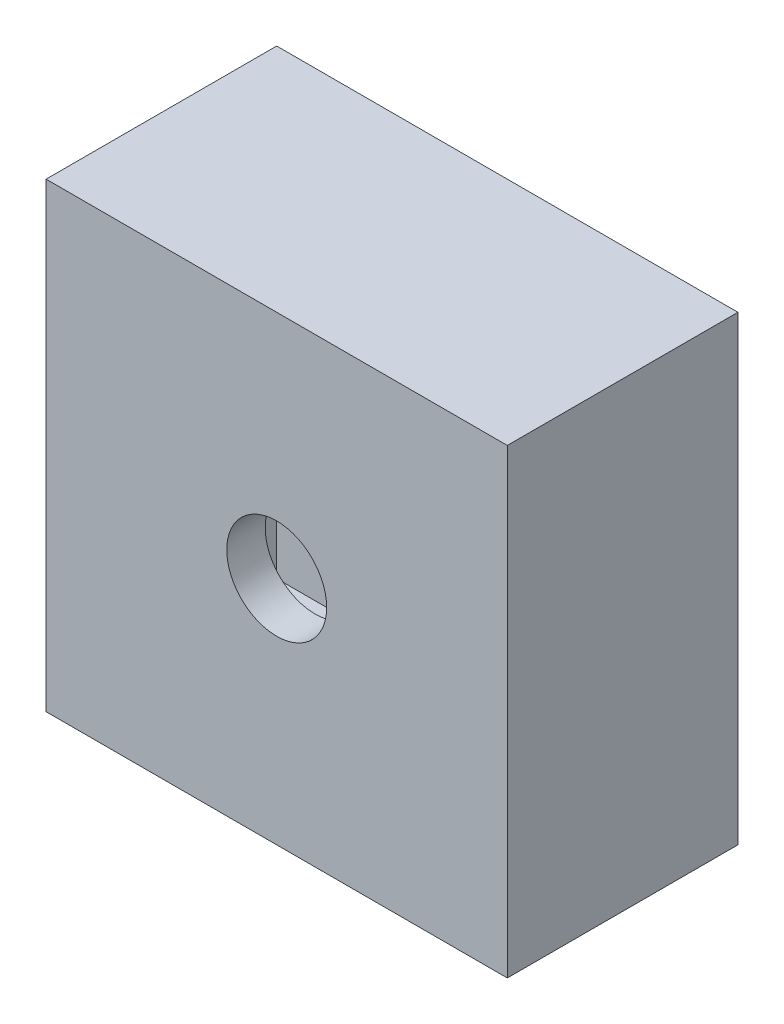
ISO-10303-21;
HEADER;
FILE_DESCRIPTION(('STEP AP214'),'2;1');
FILE_NAME('part.step','',(''),(''),'','','');
FILE_SCHEMA(('AUTOMOTIVE_DESIGN { 1 0 10303 214 1 1 1 1 }'));
ENDSEC;
DATA;
#1=APPLICATION_CONTEXT('core data for automotive mechanical design processes');
#2=APPLICATION_PROTOCOL_DEFINITION('international standard','automotive_design',2000,#1);
#3=PRODUCT_CONTEXT('',#1,'mechanical');
#4=PRODUCT('Part','Part','',(#3));
#5=PRODUCT_RELATED_PRODUCT_CATEGORY('part','',(#4));
#6=PRODUCT_DEFINITION_FORMATION('','',#4);
#7=PRODUCT_DEFINITION_CONTEXT('part definition',#1,'design');
#8=PRODUCT_DEFINITION('design','',#6,#7);
#9=PRODUCT_DEFINITION_SHAPE('','',#8);
#10=(LENGTH_UNIT() NAMED_UNIT(*) SI_UNIT(.MILLI.,.METRE.));
#11=(NAMED_UNIT(*) PLANE_ANGLE_UNIT() SI_UNIT($,.RADIAN.));
#12=(NAMED_UNIT(*) SI_UNIT($,.STERADIAN.) SOLID_ANGLE_UNIT());
#13=UNCERTAINTY_MEASURE_WITH_UNIT(LENGTH_MEASURE(1.E-05),#10,'distance_accuracy_value','');
#14=(GEOMETRIC_REPRESENTATION_CONTEXT(3) GLOBAL_UNCERTAINTY_ASSIGNED_CONTEXT((#13)) GLOBAL_UNIT_ASSIGNED_CONTEXT((#10,
#11,#12)) REPRESENTATION_CONTEXT('',''));
#15=CARTESIAN_POINT('',(0.,0.,0.));
#16=DIRECTION('',(0.,0.,1.));
#17=DIRECTION('',(1.,0.,0.));
#18=AXIS2_PLACEMENT_3D('',#15,#16,#17);
#19=CARTESIAN_POINT('',(0.,0.,100.));
#20=DIRECTION('',(0.,0.,-1.));
#21=DIRECTION('',(-1.,0.,0.));
#22=AXIS2_PLACEMENT_3D('',#19,#20,#21);
#23=PLANE('',#22);
#24=DIRECTION('',(0.,-1.,0.));
#25=VECTOR('',#24,1.);
#26=CARTESIAN_POINT('',(65.,2.26946287024804E-13,100.));
#27=LINE('',#26,#25);
#28=CARTESIAN_POINT('',(64.9999999999987,375.,100.));
#29=VERTEX_POINT('',#28);
#30=CARTESIAN_POINT('',(64.9999999999992,245.,100.));
#31=VERTEX_POINT('',#30);
#32=EDGE_CURVE('E331',#29,#31,#27,.T.);
#33=ORIENTED_EDGE('',*,*,#32,.T.);
#34=DIRECTION('',(-1.,0.,0.));
#35=VECTOR('',#34,1.);
#36=CARTESIAN_POINT('',(-8.55412928016568E-13,245.,100.));
#37=LINE('',#36,#35);
#38=CARTESIAN_POINT('',(-65.0000000000009,245.,100.));
#39=VERTEX_POINT('',#38);
#40=EDGE_CURVE('E335',#31,#39,#37,.T.);
#41=ORIENTED_EDGE('',*,*,#40,.T.);
#42=DIRECTION('',(0.,1.,0.));
#43=VECTOR('',#42,1.);
#44=CARTESIAN_POINT('',(-65.,-2.26946287024804E-13,100.));
#45=LINE('',#44,#43);
#46=CARTESIAN_POINT('',(-65.0000000000013,375.,100.));
#47=VERTEX_POINT('',#46);
#48=EDGE_CURVE('E326',#39,#47,#45,.T.);
#49=ORIENTED_EDGE('',*,*,#48,.T.);
#50=DIRECTION('',(1.,0.,0.));
#51=VECTOR('',#50,1.);
#52=CARTESIAN_POINT('',(-1.30930550206618E-12,375.,100.));
#53=LINE('',#52,#51);
#54=EDGE_CURVE('E207',#47,#29,#53,.T.);
#55=ORIENTED_EDGE('',*,*,#54,.T.);
#56=EDGE_LOOP('',(#33,#41,#49,#55));
#57=FACE_BOUND('',#56,.T.);
#58=DIRECTION('',(1.,0.,0.));
#59=VECTOR('',#58,1.);
#60=CARTESIAN_POINT('',(0.,65.,100.));
#61=LINE('',#60,#59);
#62=CARTESIAN_POINT('',(-375.,65.,100.));
#63=VERTEX_POINT('',#62);
#64=CARTESIAN_POINT('',(-245.,65.,100.));
#65=VERTEX_POINT('',#64);
#66=EDGE_CURVE('E318',#63,#65,#61,.T.);
#67=ORIENTED_EDGE('',*,*,#66,.T.);
#68=DIRECTION('',(0.,-1.,0.));
#69=VECTOR('',#68,1.);
#70=CARTESIAN_POINT('',(-245.,0.,100.));
#71=LINE('',#70,#69);
#72=CARTESIAN_POINT('',(-245.,-65.,100.));
#73=VERTEX_POINT('',#72);
#74=EDGE_CURVE('E322',#65,#73,#71,.T.);
#75=ORIENTED_EDGE('',*,*,#74,.T.);
#76=DIRECTION('',(-1.,0.,0.));
#77=VECTOR('',#76,1.);
#78=CARTESIAN_POINT('',(0.,-65.,100.));
#79=LINE('',#78,#77);
#80=CARTESIAN_POINT('',(-375.,-65.,100.));
#81=VERTEX_POINT('',#80);
#82=EDGE_CURVE('E310',#73,#81,#79,.T.);
#83=ORIENTED_EDGE('',*,*,#82,.T.);
#84=DIRECTION('',(0.,1.,0.));
#85=VECTOR('',#84,1.);
#86=CARTESIAN_POINT('',(-375.,0.,100.));
#87=LINE('',#86,#85);
#88=EDGE_CURVE('E314',#81,#63,#87,.T.);
#89=ORIENTED_EDGE('',*,*,#88,.T.);
#90=EDGE_LOOP('',(#67,#75,#83,#89));
#91=FACE_BOUND('',#90,.T.);
#92=DIRECTION('',(0.,1.,0.));
#93=VECTOR('',#92,1.);
#94=CARTESIAN_POINT('',(-65.,-6.80838861074411E-13,100.));
#95=LINE('',#94,#93);
#96=CARTESIAN_POINT('',(-64.9999999999961,-375.000000000001,100.));
#97=VERTEX_POINT('',#96);
#98=CARTESIAN_POINT('',(-64.9999999999974,-245.000000000001,100.));
#99=VERTEX_POINT('',#98);
#100=EDGE_CURVE('E302',#97,#99,#95,.T.);
#101=ORIENTED_EDGE('',*,*,#100,.T.);
#102=DIRECTION('',(1.,0.,0.));
#103=VECTOR('',#102,1.);
#104=CARTESIAN_POINT('',(2.5662387840497E-12,-245.,100.));
#105=LINE('',#104,#103);
#106=CARTESIAN_POINT('',(65.0000000000026,-244.999999999999,100.));
#107=VERTEX_POINT('',#106);
#108=EDGE_CURVE('E306',#99,#107,#105,.T.);
#109=ORIENTED_EDGE('',*,*,#108,.T.);
#110=DIRECTION('',(0.,-1.,0.));
#111=VECTOR('',#110,1.);
#112=CARTESIAN_POINT('',(65.,6.80838861074411E-13,100.));
#113=LINE('',#112,#111);
#114=CARTESIAN_POINT('',(65.0000000000039,-374.999999999999,100.));
#115=VERTEX_POINT('',#114);
#116=EDGE_CURVE('E236',#107,#115,#113,.T.);
#117=ORIENTED_EDGE('',*,*,#116,.T.);
#118=DIRECTION('',(-1.,0.,0.));
#119=VECTOR('',#118,1.);
#120=CARTESIAN_POINT('',(3.92791650619853E-12,-375.,100.));
#121=LINE('',#120,#119);
#122=EDGE_CURVE('E298',#115,#97,#121,.T.);
#123=ORIENTED_EDGE('',*,*,#122,.T.);
#124=EDGE_LOOP('',(#101,#109,#117,#123));
#125=FACE_BOUND('',#124,.T.);
#126=DIRECTION('',(-1.,0.,0.));
#127=VECTOR('',#126,1.);
#128=CARTESIAN_POINT('',(0.,-65.,100.));
#129=LINE('',#128,#127);
#130=CARTESIAN_POINT('',(375.,-65.,100.));
#131=VERTEX_POINT('',#130);
#132=CARTESIAN_POINT('',(245.,-65.,100.));
#133=VERTEX_POINT('',#132);
#134=EDGE_CURVE('E375',#131,#133,#129,.T.);
#135=ORIENTED_EDGE('',*,*,#134,.T.);
#136=DIRECTION('',(0.,1.,0.));
#137=VECTOR('',#136,1.);
#138=CARTESIAN_POINT('',(245.,0.,100.));
#139=LINE('',#138,#137);
#140=CARTESIAN_POINT('',(245.,65.,100.));
#141=VERTEX_POINT('',#140);
#142=EDGE_CURVE('E379',#133,#141,#139,.T.);
#143=ORIENTED_EDGE('',*,*,#142,.T.);
#144=DIRECTION('',(1.,0.,0.));
#145=VECTOR('',#144,1.);
#146=CARTESIAN_POINT('',(0.,65.,100.));
#147=LINE('',#146,#145);
#148=CARTESIAN_POINT('',(375.,65.,100.));
#149=VERTEX_POINT('',#148);
#150=EDGE_CURVE('E358',#141,#149,#147,.T.);
#151=ORIENTED_EDGE('',*,*,#150,.T.);
#152=DIRECTION('',(0.,-1.,0.));
#153=VECTOR('',#152,1.);
#154=CARTESIAN_POINT('',(375.,0.,100.));
#155=LINE('',#154,#153);
#156=EDGE_CURVE('E371',#149,#131,#155,.T.);
#157=ORIENTED_EDGE('',*,*,#156,.T.);
#158=EDGE_LOOP('',(#135,#143,#151,#157));
#159=FACE_BOUND('',#158,.T.);
#160=CARTESIAN_POINT('',(0.,0.,100.));
#161=DIRECTION('',(0.,0.,-1.));
#162=DIRECTION('',(-1.,0.,0.));
#163=AXIS2_PLACEMENT_3D('',#160,#161,#162);
#164=CIRCLE('',#163,130.);
#165=CARTESIAN_POINT('',(-130.,0.,100.));
#166=VERTEX_POINT('',#165);
#167=EDGE_CURVE('E391',#166,#166,#164,.F.);
#168=ORIENTED_EDGE('',*,*,#167,.F.);
#169=EDGE_LOOP('',(#168));
#170=FACE_BOUND('',#169,.T.);
#171=DIRECTION('',(0.,1.,0.));
#172=VECTOR('',#171,1.);
#173=CARTESIAN_POINT('',(500.,0.,100.));
#174=LINE('',#173,#172);
#175=CARTESIAN_POINT('',(500.,-500.,100.));
#176=VERTEX_POINT('',#175);
#177=CARTESIAN_POINT('',(500.,500.,100.));
#178=VERTEX_POINT('',#177);
#179=EDGE_CURVE('E407',#176,#178,#174,.T.);
#180=ORIENTED_EDGE('',*,*,#179,.T.);
#181=DIRECTION('',(-1.,0.,0.));
#182=VECTOR('',#181,1.);
#183=CARTESIAN_POINT('',(0.,500.,100.));
#184=LINE('',#183,#182);
#185=CARTESIAN_POINT('',(-500.,500.,100.));
#186=VERTEX_POINT('',#185);
#187=EDGE_CURVE('E411',#178,#186,#184,.T.);
#188=ORIENTED_EDGE('',*,*,#187,.T.);
#189=DIRECTION('',(0.,-1.,0.));
#190=VECTOR('',#189,1.);
#191=CARTESIAN_POINT('',(-500.,0.,100.));
#192=LINE('',#191,#190);
#193=CARTESIAN_POINT('',(-500.,-500.,100.));
#194=VERTEX_POINT('',#193);
#195=EDGE_CURVE('E425',#186,#194,#192,.T.);
#196=ORIENTED_EDGE('',*,*,#195,.T.);
#197=DIRECTION('',(1.,0.,0.));
#198=VECTOR('',#197,1.);
#199=CARTESIAN_POINT('',(0.,-500.,100.));
#200=LINE('',#199,#198);
#201=EDGE_CURVE('E421',#194,#176,#200,.T.);
#202=ORIENTED_EDGE('',*,*,#201,.T.);
#203=EDGE_LOOP('',(#180,#188,#196,#202));
#204=FACE_BOUND('',#203,.T.);
#205=ADVANCED_FACE('F39',(#57,#91,#125,#159,#170,#204),#23,.F.);
#206=CARTESIAN_POINT('',(-600.,-500.,600.));
#207=DIRECTION('',(0.,1.,0.));
#208=DIRECTION('',(0.,0.,1.));
#209=AXIS2_PLACEMENT_3D('',#206,#207,#208);
#210=PLANE('',#209);
#211=DIRECTION('',(0.,0.,-1.));
#212=VECTOR('',#211,1.);
#213=CARTESIAN_POINT('',(-500.,-500.,600.));
#214=LINE('',#213,#212);
#215=CARTESIAN_POINT('',(-500.,-500.,500.));
#216=VERTEX_POINT('',#215);
#217=EDGE_CURVE('E420',#216,#194,#214,.T.);
#218=ORIENTED_EDGE('',*,*,#217,.F.);
#219=DIRECTION('',(1.,0.,0.));
#220=VECTOR('',#219,1.);
#221=CARTESIAN_POINT('',(-600.,-500.,500.));
#222=LINE('',#221,#220);
#223=CARTESIAN_POINT('',(500.,-500.,500.));
#224=VERTEX_POINT('',#223);
#225=EDGE_CURVE('E11',#216,#224,#222,.T.);
#226=ORIENTED_EDGE('',*,*,#225,.T.);
#227=DIRECTION('',(0.,0.,-1.));
#228=VECTOR('',#227,1.);
#229=CARTESIAN_POINT('',(500.,-500.,600.));
#230=LINE('',#229,#228);
#231=EDGE_CURVE('E417',#224,#176,#230,.T.);
#232=ORIENTED_EDGE('',*,*,#231,.T.);
#233=ORIENTED_EDGE('',*,*,#201,.F.);
#234=EDGE_LOOP('',(#218,#226,#232,#233));
#235=FACE_BOUND('',#234,.T.);
#236=ADVANCED_FACE('F510',(#235),#210,.T.);
#237=CARTESIAN_POINT('',(-500.,-600.,600.));
#238=DIRECTION('',(1.,0.,0.));
#239=DIRECTION('',(0.,0.,-1.));
#240=AXIS2_PLACEMENT_3D('',#237,#238,#239);
#241=PLANE('',#240);
#242=DIRECTION('',(0.,0.,-1.));
#243=VECTOR('',#242,1.);
#244=CARTESIAN_POINT('',(-500.,500.,600.));
#245=LINE('',#244,#243);
#246=CARTESIAN_POINT('',(-500.,500.,500.));
#247=VERTEX_POINT('',#246);
#248=EDGE_CURVE('E416',#247,#186,#245,.T.);
#249=ORIENTED_EDGE('',*,*,#248,.F.);
#250=DIRECTION('',(0.,-1.,0.));
#251=VECTOR('',#250,1.);
#252=CARTESIAN_POINT('',(-500.,-600.,500.));
#253=LINE('',#252,#251);
#254=EDGE_CURVE('E395',#247,#216,#253,.T.);
#255=ORIENTED_EDGE('',*,*,#254,.T.);
#256=ORIENTED_EDGE('',*,*,#217,.T.);
#257=ORIENTED_EDGE('',*,*,#195,.F.);
#258=EDGE_LOOP('',(#249,#255,#256,#257));
#259=FACE_BOUND('',#258,.T.);
#260=ADVANCED_FACE('F515',(#259),#241,.T.);
#261=CARTESIAN_POINT('',(-600.,500.,600.));
#262=DIRECTION('',(0.,-1.,0.));
#263=DIRECTION('',(0.,0.,-1.));
#264=AXIS2_PLACEMENT_3D('',#261,#262,#263);
#265=PLANE('',#264);
#266=DIRECTION('',(0.,0.,-1.));
#267=VECTOR('',#266,1.);
#268=CARTESIAN_POINT('',(500.,500.,600.));
#269=LINE('',#268,#267);
#270=CARTESIAN_POINT('',(500.,500.,500.));
#271=VERTEX_POINT('',#270);
#272=EDGE_CURVE('E412',#271,#178,#269,.T.);
#273=ORIENTED_EDGE('',*,*,#272,.F.);
#274=DIRECTION('',(-1.,0.,0.));
#275=VECTOR('',#274,1.);
#276=CARTESIAN_POINT('',(-600.,500.,500.));
#277=LINE('',#276,#275);
#278=EDGE_CURVE('E399',#271,#247,#277,.T.);
#279=ORIENTED_EDGE('',*,*,#278,.T.);
#280=ORIENTED_EDGE('',*,*,#248,.T.);
#281=ORIENTED_EDGE('',*,*,#187,.F.);
#282=EDGE_LOOP('',(#273,#279,#280,#281));
#283=FACE_BOUND('',#282,.T.);
#284=ADVANCED_FACE('F522',(#283),#265,.T.);
#285=CARTESIAN_POINT('',(500.,-600.,600.));
#286=DIRECTION('',(-1.,0.,0.));
#287=DIRECTION('',(0.,0.,1.));
#288=AXIS2_PLACEMENT_3D('',#285,#286,#287);
#289=PLANE('',#288);
#290=ORIENTED_EDGE('',*,*,#231,.F.);
#291=DIRECTION('',(0.,1.,0.));
#292=VECTOR('',#291,1.);
#293=CARTESIAN_POINT('',(500.,-600.,500.));
#294=LINE('',#293,#292);
#295=EDGE_CURVE('E403',#224,#271,#294,.T.);
#296=ORIENTED_EDGE('',*,*,#295,.T.);
#297=ORIENTED_EDGE('',*,*,#272,.T.);
#298=ORIENTED_EDGE('',*,*,#179,.F.);
#299=EDGE_LOOP('',(#290,#296,#297,#298));
#300=FACE_BOUND('',#299,.T.);
#301=ADVANCED_FACE('F526',(#300),#289,.T.);
#302=CARTESIAN_POINT('',(0.,0.,500.));
#303=DIRECTION('',(0.,0.,1.));
#304=DIRECTION('',(1.,0.,0.));
#305=AXIS2_PLACEMENT_3D('',#302,#303,#304);
#306=PLANE('',#305);
#307=CARTESIAN_POINT('',(0.,0.,500.));
#308=DIRECTION('',(0.,0.,1.));
#309=DIRECTION('',(1.,0.,0.));
#310=AXIS2_PLACEMENT_3D('',#307,#308,#309);
#311=CIRCLE('',#310,130.);
#312=CARTESIAN_POINT('',(130.,0.,500.));
#313=VERTEX_POINT('',#312);
#314=EDGE_CURVE('E43',#313,#313,#311,.F.);
#315=ORIENTED_EDGE('',*,*,#314,.F.);
#316=EDGE_LOOP('',(#315));
#317=FACE_BOUND('',#316,.T.);
#318=ORIENTED_EDGE('',*,*,#295,.F.);
#319=ORIENTED_EDGE('',*,*,#225,.F.);
#320=ORIENTED_EDGE('',*,*,#254,.F.);
#321=ORIENTED_EDGE('',*,*,#278,.F.);
#322=EDGE_LOOP('',(#318,#319,#320,#321));
#323=FACE_BOUND('',#322,.T.);
#324=ADVANCED_FACE('F530',(#317,#323),#306,.F.);
#325=CARTESIAN_POINT('',(0.,0.,600.));
#326=DIRECTION('',(0.,0.,-1.));
#327=DIRECTION('',(-1.,0.,0.));
#328=AXIS2_PLACEMENT_3D('',#325,#326,#327);
#329=CYLINDRICAL_SURFACE('',#328,130.);
#330=CARTESIAN_POINT('',(0.,0.,600.));
#331=DIRECTION('',(0.,0.,1.));
#332=DIRECTION('',(1.,0.,0.));
#333=AXIS2_PLACEMENT_3D('',#330,#331,#332);
#334=CIRCLE('',#333,130.);
#335=CARTESIAN_POINT('',(130.,0.,600.));
#336=VERTEX_POINT('',#335);
#337=EDGE_CURVE('E384',#336,#336,#334,.T.);
#338=ORIENTED_EDGE('',*,*,#337,.T.);
#339=EDGE_LOOP('',(#338));
#340=FACE_BOUND('',#339,.T.);
#341=ORIENTED_EDGE('',*,*,#314,.T.);
#342=EDGE_LOOP('',(#341));
#343=FACE_BOUND('',#342,.T.);
#344=ADVANCED_FACE('F503',(#340,#343),#329,.F.);
#345=CARTESIAN_POINT('',(0.,0.,0.));
#346=DIRECTION('',(0.,0.,1.));
#347=DIRECTION('',(1.,0.,0.));
#348=AXIS2_PLACEMENT_3D('',#345,#346,#347);
#349=CIRCLE('',#348,130.);
#350=CARTESIAN_POINT('',(130.,0.,0.));
#351=VERTEX_POINT('',#350);
#352=EDGE_CURVE('E383',#351,#351,#349,.T.);
#353=ORIENTED_EDGE('',*,*,#352,.F.);
#354=EDGE_LOOP('',(#353));
#355=FACE_BOUND('',#354,.T.);
#356=ORIENTED_EDGE('',*,*,#167,.T.);
#357=EDGE_LOOP('',(#356));
#358=FACE_BOUND('',#357,.T.);
#359=ADVANCED_FACE('F496',(#355,#358),#329,.F.);
#360=CARTESIAN_POINT('',(0.,0.,600.));
#361=DIRECTION('',(0.,0.,-1.));
#362=DIRECTION('',(-1.,0.,0.));
#363=AXIS2_PLACEMENT_3D('',#360,#361,#362);
#364=PLANE('',#363);
#365=ORIENTED_EDGE('',*,*,#337,.F.);
#366=EDGE_LOOP('',(#365));
#367=FACE_BOUND('',#366,.T.);
#368=DIRECTION('',(0.,1.,0.));
#369=VECTOR('',#368,1.);
#370=CARTESIAN_POINT('',(600.,-600.,600.));
#371=LINE('',#370,#369);
#372=CARTESIAN_POINT('',(600.,-600.,600.));
#373=VERTEX_POINT('',#372);
#374=CARTESIAN_POINT('',(600.,600.,600.));
#375=VERTEX_POINT('',#374);
#376=EDGE_CURVE('E436',#373,#375,#371,.T.);
#377=ORIENTED_EDGE('',*,*,#376,.T.);
#378=DIRECTION('',(-1.,0.,0.));
#379=VECTOR('',#378,1.);
#380=CARTESIAN_POINT('',(-600.,600.,600.));
#381=LINE('',#380,#379);
#382=CARTESIAN_POINT('',(-600.,600.,600.));
#383=VERTEX_POINT('',#382);
#384=EDGE_CURVE('E440',#375,#383,#381,.T.);
#385=ORIENTED_EDGE('',*,*,#384,.T.);
#386=DIRECTION('',(0.,-1.,0.));
#387=VECTOR('',#386,1.);
#388=CARTESIAN_POINT('',(-600.,-600.,600.));
#389=LINE('',#388,#387);
#390=CARTESIAN_POINT('',(-600.,-600.,600.));
#391=VERTEX_POINT('',#390);
#392=EDGE_CURVE('E444',#383,#391,#389,.T.);
#393=ORIENTED_EDGE('',*,*,#392,.T.);
#394=DIRECTION('',(1.,0.,0.));
#395=VECTOR('',#394,1.);
#396=CARTESIAN_POINT('',(-600.,-600.,600.));
#397=LINE('',#396,#395);
#398=EDGE_CURVE('E447',#391,#373,#397,.T.);
#399=ORIENTED_EDGE('',*,*,#398,.T.);
#400=EDGE_LOOP('',(#377,#385,#393,#399));
#401=FACE_BOUND('',#400,.T.);
#402=ADVANCED_FACE('F494',(#367,#401),#364,.F.);
#403=CARTESIAN_POINT('',(600.,-600.,600.));
#404=DIRECTION('',(-1.,0.,0.));
#405=DIRECTION('',(0.,0.,1.));
#406=AXIS2_PLACEMENT_3D('',#403,#404,#405);
#407=PLANE('',#406);
#408=DIRECTION('',(0.,0.,-1.));
#409=VECTOR('',#408,1.);
#410=CARTESIAN_POINT('',(600.,-600.,600.));
#411=LINE('',#410,#409);
#412=CARTESIAN_POINT('',(600.,-600.,0.));
#413=VERTEX_POINT('',#412);
#414=EDGE_CURVE('E450',#373,#413,#411,.T.);
#415=ORIENTED_EDGE('',*,*,#414,.T.);
#416=DIRECTION('',(0.,1.,0.));
#417=VECTOR('',#416,1.);
#418=CARTESIAN_POINT('',(600.,-600.,0.));
#419=LINE('',#418,#417);
#420=CARTESIAN_POINT('',(600.,600.,0.));
#421=VERTEX_POINT('',#420);
#422=EDGE_CURVE('E415',#413,#421,#419,.T.);
#423=ORIENTED_EDGE('',*,*,#422,.T.);
#424=DIRECTION('',(0.,0.,-1.));
#425=VECTOR('',#424,1.);
#426=CARTESIAN_POINT('',(600.,600.,600.));
#427=LINE('',#426,#425);
#428=EDGE_CURVE('E49',#375,#421,#427,.T.);
#429=ORIENTED_EDGE('',*,*,#428,.F.);
#430=ORIENTED_EDGE('',*,*,#376,.F.);
#431=EDGE_LOOP('',(#415,#423,#429,#430));
#432=FACE_BOUND('',#431,.T.);
#433=ADVANCED_FACE('F41',(#432),#407,.F.);
#434=CARTESIAN_POINT('',(-600.,600.,600.));
#435=DIRECTION('',(0.,-1.,0.));
#436=DIRECTION('',(0.,0.,-1.));
#437=AXIS2_PLACEMENT_3D('',#434,#435,#436);
#438=PLANE('',#437);
#439=ORIENTED_EDGE('',*,*,#428,.T.);
#440=DIRECTION('',(-1.,0.,0.));
#441=VECTOR('',#440,1.);
#442=CARTESIAN_POINT('',(-600.,600.,0.));
#443=LINE('',#442,#441);
#444=CARTESIAN_POINT('',(-600.,600.,0.));
#445=VERTEX_POINT('',#444);
#446=EDGE_CURVE('E454',#421,#445,#443,.T.);
#447=ORIENTED_EDGE('',*,*,#446,.T.);
#448=DIRECTION('',(0.,0.,-1.));
#449=VECTOR('',#448,1.);
#450=CARTESIAN_POINT('',(-600.,600.,600.));
#451=LINE('',#450,#449);
#452=EDGE_CURVE('E470',#383,#445,#451,.T.);
#453=ORIENTED_EDGE('',*,*,#452,.F.);
#454=ORIENTED_EDGE('',*,*,#384,.F.);
#455=EDGE_LOOP('',(#439,#447,#453,#454));
#456=FACE_BOUND('',#455,.T.);
#457=ADVANCED_FACE('F477',(#456),#438,.F.);
#458=CARTESIAN_POINT('',(-600.,-600.,600.));
#459=DIRECTION('',(1.,0.,0.));
#460=DIRECTION('',(0.,0.,-1.));
#461=AXIS2_PLACEMENT_3D('',#458,#459,#460);
#462=PLANE('',#461);
#463=ORIENTED_EDGE('',*,*,#452,.T.);
#464=DIRECTION('',(0.,-1.,0.));
#465=VECTOR('',#464,1.);
#466=CARTESIAN_POINT('',(-600.,-600.,0.));
#467=LINE('',#466,#465);
#468=CARTESIAN_POINT('',(-600.,-600.,0.));
#469=VERTEX_POINT('',#468);
#470=EDGE_CURVE('E458',#445,#469,#467,.T.);
#471=ORIENTED_EDGE('',*,*,#470,.T.);
#472=DIRECTION('',(0.,0.,-1.));
#473=VECTOR('',#472,1.);
#474=CARTESIAN_POINT('',(-600.,-600.,600.));
#475=LINE('',#474,#473);
#476=EDGE_CURVE('E467',#391,#469,#475,.T.);
#477=ORIENTED_EDGE('',*,*,#476,.F.);
#478=ORIENTED_EDGE('',*,*,#392,.F.);
#479=EDGE_LOOP('',(#463,#471,#477,#478));
#480=FACE_BOUND('',#479,.T.);
#481=ADVANCED_FACE('F492',(#480),#462,.F.);
#482=CARTESIAN_POINT('',(-600.,-600.,600.));
#483=DIRECTION('',(0.,1.,0.));
#484=DIRECTION('',(0.,0.,1.));
#485=AXIS2_PLACEMENT_3D('',#482,#483,#484);
#486=PLANE('',#485);
#487=ORIENTED_EDGE('',*,*,#476,.T.);
#488=DIRECTION('',(1.,0.,0.));
#489=VECTOR('',#488,1.);
#490=CARTESIAN_POINT('',(-600.,-600.,0.));
#491=LINE('',#490,#489);
#492=EDGE_CURVE('E441',#469,#413,#491,.T.);
#493=ORIENTED_EDGE('',*,*,#492,.T.);
#494=ORIENTED_EDGE('',*,*,#414,.F.);
#495=ORIENTED_EDGE('',*,*,#398,.F.);
#496=EDGE_LOOP('',(#487,#493,#494,#495));
#497=FACE_BOUND('',#496,.T.);
#498=ADVANCED_FACE('F488',(#497),#486,.F.);
#499=CARTESIAN_POINT('',(0.,0.,0.));
#500=DIRECTION('',(0.,0.,-1.));
#501=DIRECTION('',(-1.,0.,0.));
#502=AXIS2_PLACEMENT_3D('',#499,#500,#501);
#503=PLANE('',#502);
#504=DIRECTION('',(-1.,0.,0.));
#505=VECTOR('',#504,1.);
#506=CARTESIAN_POINT('',(64.9999999999992,245.,0.));
#507=LINE('',#506,#505);
#508=CARTESIAN_POINT('',(64.9999999999992,245.,0.));
#509=VERTEX_POINT('',#508);
#510=CARTESIAN_POINT('',(-65.0000000000009,245.,0.));
#511=VERTEX_POINT('',#510);
#512=EDGE_CURVE('E221',#509,#511,#507,.T.);
#513=ORIENTED_EDGE('',*,*,#512,.F.);
#514=DIRECTION('',(0.,-1.,0.));
#515=VECTOR('',#514,1.);
#516=CARTESIAN_POINT('',(64.9999999999987,375.,0.));
#517=LINE('',#516,#515);
#518=CARTESIAN_POINT('',(64.9999999999987,375.,0.));
#519=VERTEX_POINT('',#518);
#520=EDGE_CURVE('E226',#519,#509,#517,.T.);
#521=ORIENTED_EDGE('',*,*,#520,.F.);
#522=DIRECTION('',(1.,0.,0.));
#523=VECTOR('',#522,1.);
#524=CARTESIAN_POINT('',(64.9999999999987,375.,0.));
#525=LINE('',#524,#523);
#526=CARTESIAN_POINT('',(-65.0000000000013,375.,0.));
#527=VERTEX_POINT('',#526);
#528=EDGE_CURVE('E204',#527,#519,#525,.T.);
#529=ORIENTED_EDGE('',*,*,#528,.F.);
#530=DIRECTION('',(0.,1.,0.));
#531=VECTOR('',#530,1.);
#532=CARTESIAN_POINT('',(-65.0000000000013,375.,0.));
#533=LINE('',#532,#531);
#534=EDGE_CURVE('E215',#511,#527,#533,.T.);
#535=ORIENTED_EDGE('',*,*,#534,.F.);
#536=EDGE_LOOP('',(#513,#521,#529,#535));
#537=FACE_BOUND('',#536,.T.);
#538=DIRECTION('',(0.,-1.,0.));
#539=VECTOR('',#538,1.);
#540=CARTESIAN_POINT('',(-245.,65.,0.));
#541=LINE('',#540,#539);
#542=CARTESIAN_POINT('',(-245.,65.,0.));
#543=VERTEX_POINT('',#542);
#544=CARTESIAN_POINT('',(-245.,-65.,0.));
#545=VERTEX_POINT('',#544);
#546=EDGE_CURVE('E241',#543,#545,#541,.T.);
#547=ORIENTED_EDGE('',*,*,#546,.F.);
#548=DIRECTION('',(1.,0.,0.));
#549=VECTOR('',#548,1.);
#550=CARTESIAN_POINT('',(-375.,65.,0.));
#551=LINE('',#550,#549);
#552=CARTESIAN_POINT('',(-375.,65.,0.));
#553=VERTEX_POINT('',#552);
#554=EDGE_CURVE('E252',#553,#543,#551,.T.);
#555=ORIENTED_EDGE('',*,*,#554,.F.);
#556=DIRECTION('',(0.,1.,0.));
#557=VECTOR('',#556,1.);
#558=CARTESIAN_POINT('',(-375.,65.,0.));
#559=LINE('',#558,#557);
#560=CARTESIAN_POINT('',(-375.,-65.,0.));
#561=VERTEX_POINT('',#560);
#562=EDGE_CURVE('E248',#561,#553,#559,.T.);
#563=ORIENTED_EDGE('',*,*,#562,.F.);
#564=DIRECTION('',(-1.,0.,0.));
#565=VECTOR('',#564,1.);
#566=CARTESIAN_POINT('',(-375.,-65.,0.));
#567=LINE('',#566,#565);
#568=EDGE_CURVE('E244',#545,#561,#567,.T.);
#569=ORIENTED_EDGE('',*,*,#568,.F.);
#570=EDGE_LOOP('',(#547,#555,#563,#569));
#571=FACE_BOUND('',#570,.T.);
#572=DIRECTION('',(1.,0.,0.));
#573=VECTOR('',#572,1.);
#574=CARTESIAN_POINT('',(-64.9999999999974,-245.000000000001,0.));
#575=LINE('',#574,#573);
#576=CARTESIAN_POINT('',(-64.9999999999974,-245.000000000001,0.));
#577=VERTEX_POINT('',#576);
#578=CARTESIAN_POINT('',(65.0000000000026,-244.999999999999,0.));
#579=VERTEX_POINT('',#578);
#580=EDGE_CURVE('E268',#577,#579,#575,.T.);
#581=ORIENTED_EDGE('',*,*,#580,.F.);
#582=DIRECTION('',(0.,1.,0.));
#583=VECTOR('',#582,1.);
#584=CARTESIAN_POINT('',(-64.9999999999961,-375.000000000001,0.));
#585=LINE('',#584,#583);
#586=CARTESIAN_POINT('',(-64.9999999999961,-375.000000000001,0.));
#587=VERTEX_POINT('',#586);
#588=EDGE_CURVE('E279',#587,#577,#585,.T.);
#589=ORIENTED_EDGE('',*,*,#588,.F.);
#590=DIRECTION('',(-1.,0.,0.));
#591=VECTOR('',#590,1.);
#592=CARTESIAN_POINT('',(-64.9999999999961,-375.000000000001,0.));
#593=LINE('',#592,#591);
#594=CARTESIAN_POINT('',(65.0000000000039,-374.999999999999,0.));
#595=VERTEX_POINT('',#594);
#596=EDGE_CURVE('E275',#595,#587,#593,.T.);
#597=ORIENTED_EDGE('',*,*,#596,.F.);
#598=DIRECTION('',(0.,-1.,0.));
#599=VECTOR('',#598,1.);
#600=CARTESIAN_POINT('',(65.0000000000039,-374.999999999999,0.));
#601=LINE('',#600,#599);
#602=EDGE_CURVE('E271',#579,#595,#601,.T.);
#603=ORIENTED_EDGE('',*,*,#602,.F.);
#604=EDGE_LOOP('',(#581,#589,#597,#603));
#605=FACE_BOUND('',#604,.T.);
#606=DIRECTION('',(0.,1.,0.));
#607=VECTOR('',#606,1.);
#608=CARTESIAN_POINT('',(245.,-65.,0.));
#609=LINE('',#608,#607);
#610=CARTESIAN_POINT('',(245.,-65.,0.));
#611=VERTEX_POINT('',#610);
#612=CARTESIAN_POINT('',(245.,65.,0.));
#613=VERTEX_POINT('',#612);
#614=EDGE_CURVE('E339',#611,#613,#609,.T.);
#615=ORIENTED_EDGE('',*,*,#614,.F.);
#616=DIRECTION('',(-1.,0.,0.));
#617=VECTOR('',#616,1.);
#618=CARTESIAN_POINT('',(375.,-65.,0.));
#619=LINE('',#618,#617);
#620=CARTESIAN_POINT('',(375.,-65.,0.));
#621=VERTEX_POINT('',#620);
#622=EDGE_CURVE('E350',#621,#611,#619,.T.);
#623=ORIENTED_EDGE('',*,*,#622,.F.);
#624=DIRECTION('',(0.,-1.,0.));
#625=VECTOR('',#624,1.);
#626=CARTESIAN_POINT('',(375.,-65.,0.));
#627=LINE('',#626,#625);
#628=CARTESIAN_POINT('',(375.,65.,0.));
#629=VERTEX_POINT('',#628);
#630=EDGE_CURVE('E346',#629,#621,#627,.T.);
#631=ORIENTED_EDGE('',*,*,#630,.F.);
#632=DIRECTION('',(1.,0.,0.));
#633=VECTOR('',#632,1.);
#634=CARTESIAN_POINT('',(375.,65.,0.));
#635=LINE('',#634,#633);
#636=EDGE_CURVE('E342',#613,#629,#635,.T.);
#637=ORIENTED_EDGE('',*,*,#636,.F.);
#638=EDGE_LOOP('',(#615,#623,#631,#637));
#639=FACE_BOUND('',#638,.T.);
#640=ORIENTED_EDGE('',*,*,#352,.T.);
#641=EDGE_LOOP('',(#640));
#642=FACE_BOUND('',#641,.T.);
#643=ORIENTED_EDGE('',*,*,#422,.F.);
#644=ORIENTED_EDGE('',*,*,#492,.F.);
#645=ORIENTED_EDGE('',*,*,#470,.F.);
#646=ORIENTED_EDGE('',*,*,#446,.F.);
#647=EDGE_LOOP('',(#643,#644,#645,#646));
#648=FACE_BOUND('',#647,.T.);
#649=ADVANCED_FACE('F223',(#537,#571,#605,#639,#642,#648),#503,.T.);
#650=CARTESIAN_POINT('',(245.,-65.,150.));
#651=DIRECTION('',(-1.,0.,0.));
#652=DIRECTION('',(0.,0.,1.));
#653=AXIS2_PLACEMENT_3D('',#650,#651,#652);
#654=PLANE('',#653);
#655=DIRECTION('',(0.,0.,-1.));
#656=VECTOR('',#655,1.);
#657=CARTESIAN_POINT('',(245.,-65.,150.));
#658=LINE('',#657,#656);
#659=EDGE_CURVE('E355',#133,#611,#658,.T.);
#660=ORIENTED_EDGE('',*,*,#659,.T.);
#661=ORIENTED_EDGE('',*,*,#614,.T.);
#662=DIRECTION('',(0.,0.,-1.));
#663=VECTOR('',#662,1.);
#664=CARTESIAN_POINT('',(245.,65.,150.));
#665=LINE('',#664,#663);
#666=EDGE_CURVE('E354',#141,#613,#665,.T.);
#667=ORIENTED_EDGE('',*,*,#666,.F.);
#668=ORIENTED_EDGE('',*,*,#142,.F.);
#669=EDGE_LOOP('',(#660,#661,#667,#668));
#670=FACE_BOUND('',#669,.T.);
#671=ADVANCED_FACE('F535',(#670),#654,.F.);
#672=CARTESIAN_POINT('',(375.,-65.,150.));
#673=DIRECTION('',(0.,-1.,0.));
#674=DIRECTION('',(0.,0.,-1.));
#675=AXIS2_PLACEMENT_3D('',#672,#673,#674);
#676=PLANE('',#675);
#677=DIRECTION('',(0.,0.,-1.));
#678=VECTOR('',#677,1.);
#679=CARTESIAN_POINT('',(375.,-65.,150.));
#680=LINE('',#679,#678);
#681=EDGE_CURVE('E359',#131,#621,#680,.T.);
#682=ORIENTED_EDGE('',*,*,#681,.T.);
#683=ORIENTED_EDGE('',*,*,#622,.T.);
#684=ORIENTED_EDGE('',*,*,#659,.F.);
#685=ORIENTED_EDGE('',*,*,#134,.F.);
#686=EDGE_LOOP('',(#682,#683,#684,#685));
#687=FACE_BOUND('',#686,.T.);
#688=ADVANCED_FACE('F538',(#687),#676,.F.);
#689=CARTESIAN_POINT('',(375.,-65.,150.));
#690=DIRECTION('',(1.,0.,0.));
#691=DIRECTION('',(0.,0.,-1.));
#692=AXIS2_PLACEMENT_3D('',#689,#690,#691);
#693=PLANE('',#692);
#694=DIRECTION('',(0.,0.,-1.));
#695=VECTOR('',#694,1.);
#696=CARTESIAN_POINT('',(375.,65.,150.));
#697=LINE('',#696,#695);
#698=EDGE_CURVE('E362',#149,#629,#697,.T.);
#699=ORIENTED_EDGE('',*,*,#698,.T.);
#700=ORIENTED_EDGE('',*,*,#630,.T.);
#701=ORIENTED_EDGE('',*,*,#681,.F.);
#702=ORIENTED_EDGE('',*,*,#156,.F.);
#703=EDGE_LOOP('',(#699,#700,#701,#702));
#704=FACE_BOUND('',#703,.T.);
#705=ADVANCED_FACE('F544',(#704),#693,.F.);
#706=CARTESIAN_POINT('',(375.,65.,150.));
#707=DIRECTION('',(0.,1.,0.));
#708=DIRECTION('',(0.,0.,1.));
#709=AXIS2_PLACEMENT_3D('',#706,#707,#708);
#710=PLANE('',#709);
#711=ORIENTED_EDGE('',*,*,#666,.T.);
#712=ORIENTED_EDGE('',*,*,#636,.T.);
#713=ORIENTED_EDGE('',*,*,#698,.F.);
#714=ORIENTED_EDGE('',*,*,#150,.F.);
#715=EDGE_LOOP('',(#711,#712,#713,#714));
#716=FACE_BOUND('',#715,.T.);
#717=ADVANCED_FACE('F540',(#716),#710,.F.);
#718=CARTESIAN_POINT('',(-64.9999999999974,-245.000000000001,150.));
#719=DIRECTION('',(0.,1.,0.));
#720=DIRECTION('',(-1.,0.,0.));
#721=AXIS2_PLACEMENT_3D('',#718,#719,#720);
#722=PLANE('',#721);
#723=DIRECTION('',(0.,0.,-1.));
#724=VECTOR('',#723,1.);
#725=CARTESIAN_POINT('',(-64.9999999999974,-245.000000000001,150.));
#726=LINE('',#725,#724);
#727=EDGE_CURVE('E245',#99,#577,#726,.T.);
#728=ORIENTED_EDGE('',*,*,#727,.T.);
#729=ORIENTED_EDGE('',*,*,#580,.T.);
#730=DIRECTION('',(0.,0.,-1.));
#731=VECTOR('',#730,1.);
#732=CARTESIAN_POINT('',(65.0000000000026,-244.999999999999,150.));
#733=LINE('',#732,#731);
#734=EDGE_CURVE('E283',#107,#579,#733,.T.);
#735=ORIENTED_EDGE('',*,*,#734,.F.);
#736=ORIENTED_EDGE('',*,*,#108,.F.);
#737=EDGE_LOOP('',(#728,#729,#735,#736));
#738=FACE_BOUND('',#737,.T.);
#739=ADVANCED_FACE('F543',(#738),#722,.F.);
#740=CARTESIAN_POINT('',(-64.9999999999961,-375.000000000001,150.));
#741=DIRECTION('',(-1.,0.,0.));
#742=DIRECTION('',(0.,-1.,0.));
#743=AXIS2_PLACEMENT_3D('',#740,#741,#742);
#744=PLANE('',#743);
#745=DIRECTION('',(0.,0.,-1.));
#746=VECTOR('',#745,1.);
#747=CARTESIAN_POINT('',(-64.9999999999961,-375.000000000001,150.));
#748=LINE('',#747,#746);
#749=EDGE_CURVE('E286',#97,#587,#748,.T.);
#750=ORIENTED_EDGE('',*,*,#749,.T.);
#751=ORIENTED_EDGE('',*,*,#588,.T.);
#752=ORIENTED_EDGE('',*,*,#727,.F.);
#753=ORIENTED_EDGE('',*,*,#100,.F.);
#754=EDGE_LOOP('',(#750,#751,#752,#753));
#755=FACE_BOUND('',#754,.T.);
#756=ADVANCED_FACE('F554',(#755),#744,.F.);
#757=CARTESIAN_POINT('',(-64.9999999999961,-375.000000000001,150.));
#758=DIRECTION('',(0.,-1.,0.));
#759=DIRECTION('',(1.,0.,0.));
#760=AXIS2_PLACEMENT_3D('',#757,#758,#759);
#761=PLANE('',#760);
#762=DIRECTION('',(0.,0.,-1.));
#763=VECTOR('',#762,1.);
#764=CARTESIAN_POINT('',(65.0000000000039,-374.999999999999,150.));
#765=LINE('',#764,#763);
#766=EDGE_CURVE('E289',#115,#595,#765,.T.);
#767=ORIENTED_EDGE('',*,*,#766,.T.);
#768=ORIENTED_EDGE('',*,*,#596,.T.);
#769=ORIENTED_EDGE('',*,*,#749,.F.);
#770=ORIENTED_EDGE('',*,*,#122,.F.);
#771=EDGE_LOOP('',(#767,#768,#769,#770));
#772=FACE_BOUND('',#771,.T.);
#773=ADVANCED_FACE('F560',(#772),#761,.F.);
#774=CARTESIAN_POINT('',(65.0000000000039,-374.999999999999,150.));
#775=DIRECTION('',(1.,0.,0.));
#776=DIRECTION('',(0.,1.,0.));
#777=AXIS2_PLACEMENT_3D('',#774,#775,#776);
#778=PLANE('',#777);
#779=ORIENTED_EDGE('',*,*,#734,.T.);
#780=ORIENTED_EDGE('',*,*,#602,.T.);
#781=ORIENTED_EDGE('',*,*,#766,.F.);
#782=ORIENTED_EDGE('',*,*,#116,.F.);
#783=EDGE_LOOP('',(#779,#780,#781,#782));
#784=FACE_BOUND('',#783,.T.);
#785=ADVANCED_FACE('F556',(#784),#778,.F.);
#786=CARTESIAN_POINT('',(-245.,65.,150.));
#787=DIRECTION('',(1.,0.,0.));
#788=DIRECTION('',(0.,0.,-1.));
#789=AXIS2_PLACEMENT_3D('',#786,#787,#788);
#790=PLANE('',#789);
#791=DIRECTION('',(0.,0.,-1.));
#792=VECTOR('',#791,1.);
#793=CARTESIAN_POINT('',(-245.,65.,150.));
#794=LINE('',#793,#792);
#795=EDGE_CURVE('E257',#65,#543,#794,.T.);
#796=ORIENTED_EDGE('',*,*,#795,.T.);
#797=ORIENTED_EDGE('',*,*,#546,.T.);
#798=DIRECTION('',(0.,0.,-1.));
#799=VECTOR('',#798,1.);
#800=CARTESIAN_POINT('',(-245.,-65.,150.));
#801=LINE('',#800,#799);
#802=EDGE_CURVE('E256',#73,#545,#801,.T.);
#803=ORIENTED_EDGE('',*,*,#802,.F.);
#804=ORIENTED_EDGE('',*,*,#74,.F.);
#805=EDGE_LOOP('',(#796,#797,#803,#804));
#806=FACE_BOUND('',#805,.T.);
#807=ADVANCED_FACE('F559',(#806),#790,.F.);
#808=CARTESIAN_POINT('',(-375.,65.,150.));
#809=DIRECTION('',(0.,1.,0.));
#810=DIRECTION('',(0.,0.,1.));
#811=AXIS2_PLACEMENT_3D('',#808,#809,#810);
#812=PLANE('',#811);
#813=DIRECTION('',(0.,0.,-1.));
#814=VECTOR('',#813,1.);
#815=CARTESIAN_POINT('',(-375.,65.,150.));
#816=LINE('',#815,#814);
#817=EDGE_CURVE('E260',#63,#553,#816,.T.);
#818=ORIENTED_EDGE('',*,*,#817,.T.);
#819=ORIENTED_EDGE('',*,*,#554,.T.);
#820=ORIENTED_EDGE('',*,*,#795,.F.);
#821=ORIENTED_EDGE('',*,*,#66,.F.);
#822=EDGE_LOOP('',(#818,#819,#820,#821));
#823=FACE_BOUND('',#822,.T.);
#824=ADVANCED_FACE('F570',(#823),#812,.F.);
#825=CARTESIAN_POINT('',(-375.,65.,150.));
#826=DIRECTION('',(-1.,0.,0.));
#827=DIRECTION('',(0.,0.,1.));
#828=AXIS2_PLACEMENT_3D('',#825,#826,#827);
#829=PLANE('',#828);
#830=DIRECTION('',(0.,0.,-1.));
#831=VECTOR('',#830,1.);
#832=CARTESIAN_POINT('',(-375.,-65.,150.));
#833=LINE('',#832,#831);
#834=EDGE_CURVE('E64',#81,#561,#833,.T.);
#835=ORIENTED_EDGE('',*,*,#834,.T.);
#836=ORIENTED_EDGE('',*,*,#562,.T.);
#837=ORIENTED_EDGE('',*,*,#817,.F.);
#838=ORIENTED_EDGE('',*,*,#88,.F.);
#839=EDGE_LOOP('',(#835,#836,#837,#838));
#840=FACE_BOUND('',#839,.T.);
#841=ADVANCED_FACE('F576',(#840),#829,.F.);
#842=CARTESIAN_POINT('',(-375.,-65.,150.));
#843=DIRECTION('',(0.,-1.,0.));
#844=DIRECTION('',(0.,0.,-1.));
#845=AXIS2_PLACEMENT_3D('',#842,#843,#844);
#846=PLANE('',#845);
#847=ORIENTED_EDGE('',*,*,#802,.T.);
#848=ORIENTED_EDGE('',*,*,#568,.T.);
#849=ORIENTED_EDGE('',*,*,#834,.F.);
#850=ORIENTED_EDGE('',*,*,#82,.F.);
#851=EDGE_LOOP('',(#847,#848,#849,#850));
#852=FACE_BOUND('',#851,.T.);
#853=ADVANCED_FACE('F572',(#852),#846,.F.);
#854=CARTESIAN_POINT('',(64.9999999999992,245.,150.));
#855=DIRECTION('',(0.,-1.,0.));
#856=DIRECTION('',(1.,0.,0.));
#857=AXIS2_PLACEMENT_3D('',#854,#855,#856);
#858=PLANE('',#857);
#859=DIRECTION('',(0.,0.,-1.));
#860=VECTOR('',#859,1.);
#861=CARTESIAN_POINT('',(64.9999999999992,245.,150.));
#862=LINE('',#861,#860);
#863=EDGE_CURVE('E233',#31,#509,#862,.T.);
#864=ORIENTED_EDGE('',*,*,#863,.T.);
#865=ORIENTED_EDGE('',*,*,#512,.T.);
#866=DIRECTION('',(0.,0.,-1.));
#867=VECTOR('',#866,1.);
#868=CARTESIAN_POINT('',(-65.0000000000009,245.,150.));
#869=LINE('',#868,#867);
#870=EDGE_CURVE('E211',#39,#511,#869,.T.);
#871=ORIENTED_EDGE('',*,*,#870,.F.);
#872=ORIENTED_EDGE('',*,*,#40,.F.);
#873=EDGE_LOOP('',(#864,#865,#871,#872));
#874=FACE_BOUND('',#873,.T.);
#875=ADVANCED_FACE('F575',(#874),#858,.F.);
#876=CARTESIAN_POINT('',(64.9999999999987,375.,150.));
#877=DIRECTION('',(1.,0.,0.));
#878=DIRECTION('',(0.,1.,0.));
#879=AXIS2_PLACEMENT_3D('',#876,#877,#878);
#880=PLANE('',#879);
#881=DIRECTION('',(0.,0.,-1.));
#882=VECTOR('',#881,1.);
#883=CARTESIAN_POINT('',(64.9999999999987,375.,150.));
#884=LINE('',#883,#882);
#885=EDGE_CURVE('E210',#29,#519,#884,.T.);
#886=ORIENTED_EDGE('',*,*,#885,.T.);
#887=ORIENTED_EDGE('',*,*,#520,.T.);
#888=ORIENTED_EDGE('',*,*,#863,.F.);
#889=ORIENTED_EDGE('',*,*,#32,.F.);
#890=EDGE_LOOP('',(#886,#887,#888,#889));
#891=FACE_BOUND('',#890,.T.);
#892=ADVANCED_FACE('F585',(#891),#880,.F.);
#893=CARTESIAN_POINT('',(64.9999999999987,375.,150.));
#894=DIRECTION('',(0.,1.,0.));
#895=DIRECTION('',(-1.,0.,0.));
#896=AXIS2_PLACEMENT_3D('',#893,#894,#895);
#897=PLANE('',#896);
#898=DIRECTION('',(0.,0.,-1.));
#899=VECTOR('',#898,1.);
#900=CARTESIAN_POINT('',(-65.0000000000013,375.,150.));
#901=LINE('',#900,#899);
#902=EDGE_CURVE('E56',#47,#527,#901,.T.);
#903=ORIENTED_EDGE('',*,*,#902,.T.);
#904=ORIENTED_EDGE('',*,*,#528,.T.);
#905=ORIENTED_EDGE('',*,*,#885,.F.);
#906=ORIENTED_EDGE('',*,*,#54,.F.);
#907=EDGE_LOOP('',(#903,#904,#905,#906));
#908=FACE_BOUND('',#907,.T.);
#909=ADVANCED_FACE('F201',(#908),#897,.F.);
#910=CARTESIAN_POINT('',(-65.0000000000013,375.,150.));
#911=DIRECTION('',(-1.,0.,0.));
#912=DIRECTION('',(0.,-1.,0.));
#913=AXIS2_PLACEMENT_3D('',#910,#911,#912);
#914=PLANE('',#913);
#915=ORIENTED_EDGE('',*,*,#870,.T.);
#916=ORIENTED_EDGE('',*,*,#534,.T.);
#917=ORIENTED_EDGE('',*,*,#902,.F.);
#918=ORIENTED_EDGE('',*,*,#48,.F.);
#919=EDGE_LOOP('',(#915,#916,#917,#918));
#920=FACE_BOUND('',#919,.T.);
#921=ADVANCED_FACE('F216',(#920),#914,.F.);
#922=CLOSED_SHELL('',(#205,#236,#260,#284,#301,#324,#344,#359,#402,#433,#457,#481,#498,#649,
#671,#688,#705,#717,#739,#756,#773,#785,#807,#824,#841,#853,#875,#892,#909,#921));
#923=MANIFOLD_SOLID_BREP('B2',#922);
#924=ADVANCED_BREP_SHAPE_REPRESENTATION('',(#18,#923),#14);
#925=SHAPE_DEFINITION_REPRESENTATION(#9,#924);
ENDSEC;
END-ISO-10303-21;
